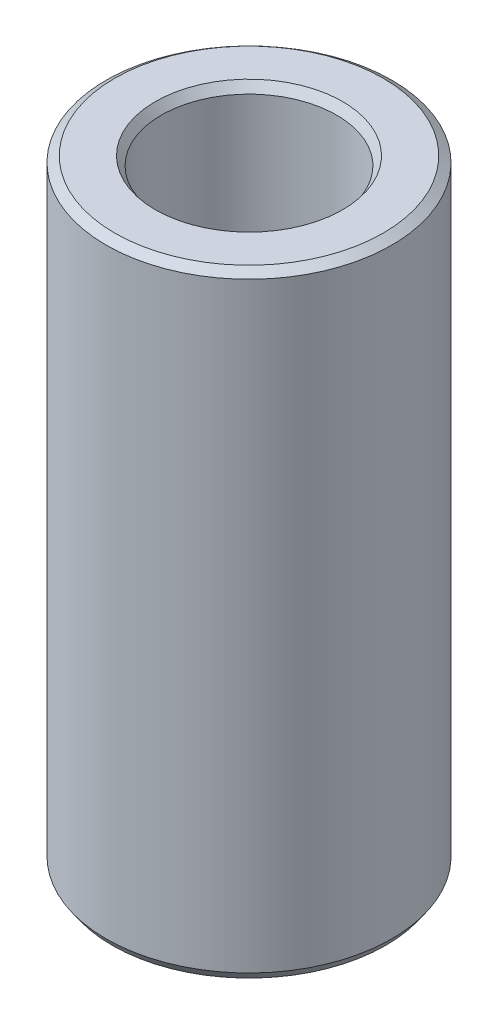
ISO-10303-21;
HEADER;
FILE_DESCRIPTION(('STEP AP214'),'2;1');
FILE_NAME('part.step','',(''),(''),'','','');
FILE_SCHEMA(('AUTOMOTIVE_DESIGN { 1 0 10303 214 1 1 1 1 }'));
ENDSEC;
DATA;
#1=APPLICATION_CONTEXT('core data for automotive mechanical design processes');
#2=APPLICATION_PROTOCOL_DEFINITION('international standard','automotive_design',2000,#1);
#3=PRODUCT_CONTEXT('',#1,'mechanical');
#4=PRODUCT('Part','Part','',(#3));
#5=PRODUCT_RELATED_PRODUCT_CATEGORY('part','',(#4));
#6=PRODUCT_DEFINITION_FORMATION('','',#4);
#7=PRODUCT_DEFINITION_CONTEXT('part definition',#1,'design');
#8=PRODUCT_DEFINITION('design','',#6,#7);
#9=PRODUCT_DEFINITION_SHAPE('','',#8);
#10=(LENGTH_UNIT() NAMED_UNIT(*) SI_UNIT(.MILLI.,.METRE.));
#11=(NAMED_UNIT(*) PLANE_ANGLE_UNIT() SI_UNIT($,.RADIAN.));
#12=(NAMED_UNIT(*) SI_UNIT($,.STERADIAN.) SOLID_ANGLE_UNIT());
#13=UNCERTAINTY_MEASURE_WITH_UNIT(LENGTH_MEASURE(1.E-05),#10,'distance_accuracy_value','');
#14=(GEOMETRIC_REPRESENTATION_CONTEXT(3) GLOBAL_UNCERTAINTY_ASSIGNED_CONTEXT((#13)) GLOBAL_UNIT_ASSIGNED_CONTEXT((#10,
#11,#12)) REPRESENTATION_CONTEXT('',''));
#15=CARTESIAN_POINT('',(0.,0.,0.));
#16=DIRECTION('',(0.,0.,1.));
#17=DIRECTION('',(1.,0.,0.));
#18=AXIS2_PLACEMENT_3D('',#15,#16,#17);
#19=CARTESIAN_POINT('',(0.,53.8507695219593,0.));
#20=DIRECTION('',(0.,-1.,0.));
#21=DIRECTION('',(0.,0.,-1.));
#22=AXIS2_PLACEMENT_3D('',#19,#20,#21);
#23=CYLINDRICAL_SURFACE('',#22,12.5);
#24=CARTESIAN_POINT('',(0.,0.75897655047133,0.));
#25=DIRECTION('',(0.,1.,0.));
#26=DIRECTION('',(0.,0.,1.));
#27=AXIS2_PLACEMENT_3D('',#24,#25,#26);
#28=CIRCLE('',#27,12.5);
#29=CARTESIAN_POINT('',(0.,0.75897655047133,12.5));
#30=VERTEX_POINT('',#29);
#31=EDGE_CURVE('E10',#30,#30,#28,.T.);
#32=ORIENTED_EDGE('',*,*,#31,.T.);
#33=EDGE_LOOP('',(#32));
#34=FACE_BOUND('',#33,.T.);
#35=CARTESIAN_POINT('',(0.,53.3234238351389,0.));
#36=DIRECTION('',(0.,1.,0.));
#37=DIRECTION('',(0.,0.,1.));
#38=AXIS2_PLACEMENT_3D('',#35,#36,#37);
#39=CIRCLE('',#38,12.5);
#40=CARTESIAN_POINT('',(0.,53.3234238351389,12.5));
#41=VERTEX_POINT('',#40);
#42=EDGE_CURVE('E50',#41,#41,#39,.F.);
#43=ORIENTED_EDGE('',*,*,#42,.T.);
#44=EDGE_LOOP('',(#43));
#45=FACE_BOUND('',#44,.T.);
#46=ADVANCED_FACE('F39',(#34,#45),#23,.T.);
#47=CARTESIAN_POINT('',(0.,53.8507695219593,0.));
#48=DIRECTION('',(0.,1.,0.));
#49=DIRECTION('',(0.,0.,1.));
#50=AXIS2_PLACEMENT_3D('',#47,#48,#49);
#51=PLANE('',#50);
#52=CARTESIAN_POINT('',(0.,53.8507695219593,0.));
#53=DIRECTION('',(0.,1.,0.));
#54=DIRECTION('',(0.,0.,1.));
#55=AXIS2_PLACEMENT_3D('',#52,#53,#54);
#56=CIRCLE('',#55,8.19827672281414);
#57=CARTESIAN_POINT('',(0.,53.8507695219593,8.19827672281414));
#58=VERTEX_POINT('',#57);
#59=EDGE_CURVE('E58',#58,#58,#56,.F.);
#60=ORIENTED_EDGE('',*,*,#59,.T.);
#61=EDGE_LOOP('',(#60));
#62=FACE_BOUND('',#61,.T.);
#63=CARTESIAN_POINT('',(0.,53.8507695219593,0.));
#64=DIRECTION('',(0.,1.,0.));
#65=DIRECTION('',(0.,0.,1.));
#66=AXIS2_PLACEMENT_3D('',#63,#64,#65);
#67=CIRCLE('',#66,11.7410234495287);
#68=CARTESIAN_POINT('',(0.,53.8507695219593,11.7410234495287));
#69=VERTEX_POINT('',#68);
#70=EDGE_CURVE('E61',#69,#69,#67,.T.);
#71=ORIENTED_EDGE('',*,*,#70,.T.);
#72=EDGE_LOOP('',(#71));
#73=FACE_BOUND('',#72,.T.);
#74=ADVANCED_FACE('F88',(#62,#73),#51,.T.);
#75=CARTESIAN_POINT('',(0.,0.,0.));
#76=DIRECTION('',(0.,1.,0.));
#77=DIRECTION('',(0.,0.,1.));
#78=AXIS2_PLACEMENT_3D('',#75,#76,#77);
#79=PLANE('',#78);
#80=CARTESIAN_POINT('',(0.,0.,0.));
#81=DIRECTION('',(0.,1.,0.));
#82=DIRECTION('',(0.,0.,1.));
#83=AXIS2_PLACEMENT_3D('',#80,#81,#82);
#84=CIRCLE('',#83,8.42990758646509);
#85=CARTESIAN_POINT('',(0.,0.,8.42990758646509));
#86=VERTEX_POINT('',#85);
#87=EDGE_CURVE('E51',#86,#86,#84,.T.);
#88=ORIENTED_EDGE('',*,*,#87,.T.);
#89=EDGE_LOOP('',(#88));
#90=FACE_BOUND('',#89,.T.);
#91=CARTESIAN_POINT('',(0.,0.,0.));
#92=DIRECTION('',(0.,1.,0.));
#93=DIRECTION('',(0.,0.,1.));
#94=AXIS2_PLACEMENT_3D('',#91,#92,#93);
#95=CIRCLE('',#94,11.9726543131797);
#96=CARTESIAN_POINT('',(0.,0.,11.9726543131797));
#97=VERTEX_POINT('',#96);
#98=EDGE_CURVE('E54',#97,#97,#95,.F.);
#99=ORIENTED_EDGE('',*,*,#98,.T.);
#100=EDGE_LOOP('',(#99));
#101=FACE_BOUND('',#100,.T.);
#102=ADVANCED_FACE('F83',(#90,#101),#79,.F.);
#103=CARTESIAN_POINT('',(0.,53.8507695219593,0.));
#104=DIRECTION('',(0.,-1.,0.));
#105=DIRECTION('',(0.,0.,-1.));
#106=AXIS2_PLACEMENT_3D('',#103,#104,#105);
#107=CYLINDRICAL_SURFACE('',#106,7.67093103599376);
#108=CARTESIAN_POINT('',(0.,53.0917929714879,0.));
#109=DIRECTION('',(0.,1.,0.));
#110=DIRECTION('',(0.,0.,1.));
#111=AXIS2_PLACEMENT_3D('',#108,#109,#110);
#112=CIRCLE('',#111,7.67093103599376);
#113=CARTESIAN_POINT('',(0.,53.0917929714879,7.67093103599376));
#114=VERTEX_POINT('',#113);
#115=EDGE_CURVE('E67',#114,#114,#112,.T.);
#116=ORIENTED_EDGE('',*,*,#115,.T.);
#117=EDGE_LOOP('',(#116));
#118=FACE_BOUND('',#117,.T.);
#119=CARTESIAN_POINT('',(0.,0.527345686820349,0.));
#120=DIRECTION('',(0.,1.,0.));
#121=DIRECTION('',(0.,0.,1.));
#122=AXIS2_PLACEMENT_3D('',#119,#120,#121);
#123=CIRCLE('',#122,7.67093103599376);
#124=CARTESIAN_POINT('',(0.,0.527345686820349,7.67093103599376));
#125=VERTEX_POINT('',#124);
#126=EDGE_CURVE('E69',#125,#125,#123,.F.);
#127=ORIENTED_EDGE('',*,*,#126,.T.);
#128=EDGE_LOOP('',(#127));
#129=FACE_BOUND('',#128,.T.);
#130=ADVANCED_FACE('F71',(#118,#129),#107,.F.);
#131=CARTESIAN_POINT('',(0.,53.0917929714879,0.));
#132=DIRECTION('',(0.,1.,0.));
#133=DIRECTION('',(0.,0.,1.));
#134=AXIS2_PLACEMENT_3D('',#131,#132,#133);
#135=CONICAL_SURFACE('',#134,7.67093103599376,0.607235300592431);
#136=ORIENTED_EDGE('',*,*,#59,.F.);
#137=EDGE_LOOP('',(#136));
#138=FACE_BOUND('',#137,.T.);
#139=ORIENTED_EDGE('',*,*,#115,.F.);
#140=EDGE_LOOP('',(#139));
#141=FACE_BOUND('',#140,.T.);
#142=ADVANCED_FACE('F77',(#138,#141),#135,.F.);
#143=CARTESIAN_POINT('',(0.,0.,0.));
#144=DIRECTION('',(0.,-1.,0.));
#145=DIRECTION('',(0.,0.,-1.));
#146=AXIS2_PLACEMENT_3D('',#143,#144,#145);
#147=CONICAL_SURFACE('',#146,8.42990758646509,0.963561026202464);
#148=ORIENTED_EDGE('',*,*,#126,.F.);
#149=EDGE_LOOP('',(#148));
#150=FACE_BOUND('',#149,.T.);
#151=ORIENTED_EDGE('',*,*,#87,.F.);
#152=EDGE_LOOP('',(#151));
#153=FACE_BOUND('',#152,.T.);
#154=ADVANCED_FACE('F73',(#150,#153),#147,.F.);
#155=CARTESIAN_POINT('',(0.,0.75897655047133,0.));
#156=DIRECTION('',(0.,1.,0.));
#157=DIRECTION('',(0.,0.,1.));
#158=AXIS2_PLACEMENT_3D('',#155,#156,#157);
#159=CONICAL_SURFACE('',#158,12.5,0.607235300592433);
#160=ORIENTED_EDGE('',*,*,#98,.F.);
#161=EDGE_LOOP('',(#160));
#162=FACE_BOUND('',#161,.T.);
#163=ORIENTED_EDGE('',*,*,#31,.F.);
#164=EDGE_LOOP('',(#163));
#165=FACE_BOUND('',#164,.T.);
#166=ADVANCED_FACE('F76',(#162,#165),#159,.T.);
#167=CARTESIAN_POINT('',(0.,53.8507695219593,0.));
#168=DIRECTION('',(0.,-1.,0.));
#169=DIRECTION('',(0.,0.,-1.));
#170=AXIS2_PLACEMENT_3D('',#167,#168,#169);
#171=CONICAL_SURFACE('',#170,11.7410234495287,0.963561026202463);
#172=ORIENTED_EDGE('',*,*,#42,.F.);
#173=EDGE_LOOP('',(#172));
#174=FACE_BOUND('',#173,.T.);
#175=ORIENTED_EDGE('',*,*,#70,.F.);
#176=EDGE_LOOP('',(#175));
#177=FACE_BOUND('',#176,.T.);
#178=ADVANCED_FACE('F45',(#174,#177),#171,.T.);
#179=CLOSED_SHELL('',(#46,#74,#102,#130,#142,#154,#166,#178));
#180=MANIFOLD_SOLID_BREP('B2',#179);
#181=ADVANCED_BREP_SHAPE_REPRESENTATION('',(#18,#180),#14);
#182=SHAPE_DEFINITION_REPRESENTATION(#9,#181);
ENDSEC;
END-ISO-10303-21;
